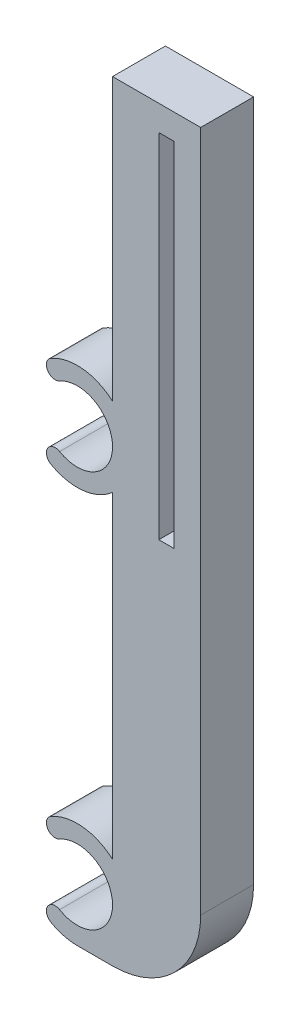
ISO-10303-21;
HEADER;
FILE_DESCRIPTION(('STEP AP214'),'2;1');
FILE_NAME('part.step','',(''),(''),'','','');
FILE_SCHEMA(('AUTOMOTIVE_DESIGN { 1 0 10303 214 1 1 1 1 }'));
ENDSEC;
DATA;
#1=APPLICATION_CONTEXT('core data for automotive mechanical design processes');
#2=APPLICATION_PROTOCOL_DEFINITION('international standard','automotive_design',2000,#1);
#3=PRODUCT_CONTEXT('',#1,'mechanical');
#4=PRODUCT('Part','Part','',(#3));
#5=PRODUCT_RELATED_PRODUCT_CATEGORY('part','',(#4));
#6=PRODUCT_DEFINITION_FORMATION('','',#4);
#7=PRODUCT_DEFINITION_CONTEXT('part definition',#1,'design');
#8=PRODUCT_DEFINITION('design','',#6,#7);
#9=PRODUCT_DEFINITION_SHAPE('','',#8);
#10=(LENGTH_UNIT() NAMED_UNIT(*) SI_UNIT(.MILLI.,.METRE.));
#11=(NAMED_UNIT(*) PLANE_ANGLE_UNIT() SI_UNIT($,.RADIAN.));
#12=(NAMED_UNIT(*) SI_UNIT($,.STERADIAN.) SOLID_ANGLE_UNIT());
#13=UNCERTAINTY_MEASURE_WITH_UNIT(LENGTH_MEASURE(1.E-05),#10,'distance_accuracy_value','');
#14=(GEOMETRIC_REPRESENTATION_CONTEXT(3) GLOBAL_UNCERTAINTY_ASSIGNED_CONTEXT((#13)) GLOBAL_UNIT_ASSIGNED_CONTEXT((#10,
#11,#12)) REPRESENTATION_CONTEXT('',''));
#15=CARTESIAN_POINT('',(0.,0.,0.));
#16=DIRECTION('',(0.,0.,1.));
#17=DIRECTION('',(1.,0.,0.));
#18=AXIS2_PLACEMENT_3D('',#15,#16,#17);
#19=CARTESIAN_POINT('',(7.50000000000032,87.3750000000002,6.));
#20=DIRECTION('',(0.,-1.,0.));
#21=DIRECTION('',(0.,0.,-1.));
#22=AXIS2_PLACEMENT_3D('',#19,#20,#21);
#23=PLANE('',#22);
#24=DIRECTION('',(-1.,0.,0.));
#25=VECTOR('',#24,1.);
#26=CARTESIAN_POINT('',(7.50000000000032,87.3750000000002,0.));
#27=LINE('',#26,#25);
#28=CARTESIAN_POINT('',(17.5000000000003,87.3750000000002,0.));
#29=VERTEX_POINT('',#28);
#30=CARTESIAN_POINT('',(7.50000000000032,87.3750000000002,0.));
#31=VERTEX_POINT('',#30);
#32=EDGE_CURVE('E188',#29,#31,#27,.T.);
#33=ORIENTED_EDGE('',*,*,#32,.T.);
#34=DIRECTION('',(0.,0.,-1.));
#35=VECTOR('',#34,1.);
#36=CARTESIAN_POINT('',(7.50000000000032,87.3750000000002,6.));
#37=LINE('',#36,#35);
#38=CARTESIAN_POINT('',(7.50000000000032,87.3750000000002,6.));
#39=VERTEX_POINT('',#38);
#40=EDGE_CURVE('E11',#39,#31,#37,.T.);
#41=ORIENTED_EDGE('',*,*,#40,.F.);
#42=DIRECTION('',(-1.,0.,0.));
#43=VECTOR('',#42,1.);
#44=CARTESIAN_POINT('',(7.50000000000032,87.3750000000002,6.));
#45=LINE('',#44,#43);
#46=CARTESIAN_POINT('',(17.5000000000003,87.3750000000002,6.));
#47=VERTEX_POINT('',#46);
#48=EDGE_CURVE('E220',#47,#39,#45,.T.);
#49=ORIENTED_EDGE('',*,*,#48,.F.);
#50=DIRECTION('',(0.,0.,-1.));
#51=VECTOR('',#50,1.);
#52=CARTESIAN_POINT('',(17.5000000000003,87.3750000000002,6.));
#53=LINE('',#52,#51);
#54=EDGE_CURVE('E184',#47,#29,#53,.T.);
#55=ORIENTED_EDGE('',*,*,#54,.T.);
#56=EDGE_LOOP('',(#33,#41,#49,#55));
#57=FACE_BOUND('',#56,.T.);
#58=ADVANCED_FACE('F32',(#57),#23,.F.);
#59=CARTESIAN_POINT('',(7.50000000000032,87.3750000000002,6.));
#60=DIRECTION('',(1.,0.,0.));
#61=DIRECTION('',(0.,1.,0.));
#62=AXIS2_PLACEMENT_3D('',#59,#60,#61);
#63=PLANE('',#62);
#64=DIRECTION('',(0.,-1.,0.));
#65=VECTOR('',#64,1.);
#66=CARTESIAN_POINT('',(7.50000000000032,87.3750000000002,0.));
#67=LINE('',#66,#65);
#68=CARTESIAN_POINT('',(7.50000000000032,55.4721359549989,0.));
#69=VERTEX_POINT('',#68);
#70=EDGE_CURVE('E191',#31,#69,#67,.T.);
#71=ORIENTED_EDGE('',*,*,#70,.T.);
#72=DIRECTION('',(0.,0.,-1.));
#73=VECTOR('',#72,1.);
#74=CARTESIAN_POINT('',(7.50000000000032,55.4721359549989,6.));
#75=LINE('',#74,#73);
#76=CARTESIAN_POINT('',(7.50000000000032,55.4721359549989,6.));
#77=VERTEX_POINT('',#76);
#78=EDGE_CURVE('E39',#77,#69,#75,.T.);
#79=ORIENTED_EDGE('',*,*,#78,.F.);
#80=DIRECTION('',(0.,-1.,0.));
#81=VECTOR('',#80,1.);
#82=CARTESIAN_POINT('',(7.50000000000032,87.3750000000002,6.));
#83=LINE('',#82,#81);
#84=EDGE_CURVE('E120',#39,#77,#83,.T.);
#85=ORIENTED_EDGE('',*,*,#84,.F.);
#86=ORIENTED_EDGE('',*,*,#40,.T.);
#87=EDGE_LOOP('',(#71,#79,#85,#86));
#88=FACE_BOUND('',#87,.T.);
#89=ADVANCED_FACE('F381',(#88),#63,.F.);
#90=CARTESIAN_POINT('',(3.50000000000152,51.,6.));
#91=DIRECTION('',(0.,0.,-1.));
#92=DIRECTION('',(-1.,0.,0.));
#93=AXIS2_PLACEMENT_3D('',#90,#91,#92);
#94=CYLINDRICAL_SURFACE('',#93,5.99999999999872);
#95=CARTESIAN_POINT('',(3.50000000000152,51.,0.));
#96=DIRECTION('',(0.,0.,1.));
#97=DIRECTION('',(-1.,0.,0.));
#98=AXIS2_PLACEMENT_3D('',#95,#96,#97);
#99=CIRCLE('',#98,5.99999999999872);
#100=CARTESIAN_POINT('',(0.500000000000728,56.1961524227046,0.));
#101=VERTEX_POINT('',#100);
#102=EDGE_CURVE('E194',#69,#101,#99,.T.);
#103=ORIENTED_EDGE('',*,*,#102,.T.);
#104=DIRECTION('',(0.,0.,-1.));
#105=VECTOR('',#104,1.);
#106=CARTESIAN_POINT('',(0.500000000000728,56.1961524227046,6.));
#107=LINE('',#106,#105);
#108=CARTESIAN_POINT('',(0.500000000000728,56.1961524227046,6.));
#109=VERTEX_POINT('',#108);
#110=EDGE_CURVE('E251',#109,#101,#107,.T.);
#111=ORIENTED_EDGE('',*,*,#110,.F.);
#112=CARTESIAN_POINT('',(3.50000000000152,51.,6.));
#113=DIRECTION('',(0.,0.,1.));
#114=DIRECTION('',(-1.,0.,0.));
#115=AXIS2_PLACEMENT_3D('',#112,#113,#114);
#116=CIRCLE('',#115,5.99999999999872);
#117=EDGE_CURVE('E259',#77,#109,#116,.T.);
#118=ORIENTED_EDGE('',*,*,#117,.F.);
#119=ORIENTED_EDGE('',*,*,#78,.T.);
#120=EDGE_LOOP('',(#103,#111,#118,#119));
#121=FACE_BOUND('',#120,.T.);
#122=ADVANCED_FACE('F257',(#121),#94,.T.);
#123=CARTESIAN_POINT('',(1.00000000000034,55.3301270189211,6.));
#124=DIRECTION('',(0.,0.,-1.));
#125=DIRECTION('',(-1.,0.,0.));
#126=AXIS2_PLACEMENT_3D('',#123,#124,#125);
#127=CYLINDRICAL_SURFACE('',#126,0.999999999998968);
#128=CARTESIAN_POINT('',(1.00000000000034,55.3301270189211,0.));
#129=DIRECTION('',(0.,0.,1.));
#130=DIRECTION('',(-1.,0.,0.));
#131=AXIS2_PLACEMENT_3D('',#128,#129,#130);
#132=CIRCLE('',#131,0.999999999998968);
#133=CARTESIAN_POINT('',(1.50000000000004,54.4641016151378,0.));
#134=VERTEX_POINT('',#133);
#135=EDGE_CURVE('E196',#101,#134,#132,.T.);
#136=ORIENTED_EDGE('',*,*,#135,.T.);
#137=DIRECTION('',(0.,0.,-1.));
#138=VECTOR('',#137,1.);
#139=CARTESIAN_POINT('',(1.50000000000004,54.4641016151378,6.));
#140=LINE('',#139,#138);
#141=CARTESIAN_POINT('',(1.50000000000004,54.4641016151378,6.));
#142=VERTEX_POINT('',#141);
#143=EDGE_CURVE('E248',#142,#134,#140,.T.);
#144=ORIENTED_EDGE('',*,*,#143,.F.);
#145=CARTESIAN_POINT('',(1.00000000000034,55.3301270189211,6.));
#146=DIRECTION('',(0.,0.,1.));
#147=DIRECTION('',(-1.,0.,0.));
#148=AXIS2_PLACEMENT_3D('',#145,#146,#147);
#149=CIRCLE('',#148,0.999999999998968);
#150=EDGE_CURVE('E277',#109,#142,#149,.T.);
#151=ORIENTED_EDGE('',*,*,#150,.F.);
#152=ORIENTED_EDGE('',*,*,#110,.T.);
#153=EDGE_LOOP('',(#136,#144,#151,#152));
#154=FACE_BOUND('',#153,.T.);
#155=ADVANCED_FACE('F268',(#154),#127,.T.);
#156=CARTESIAN_POINT('',(3.50000000000152,51.,6.));
#157=DIRECTION('',(0.,0.,-1.));
#158=DIRECTION('',(-1.,0.,0.));
#159=AXIS2_PLACEMENT_3D('',#156,#157,#158);
#160=CYLINDRICAL_SURFACE('',#159,4.0000000000008);
#161=CARTESIAN_POINT('',(3.50000000000152,51.,0.));
#162=DIRECTION('',(0.,0.,-1.));
#163=DIRECTION('',(-1.,0.,0.));
#164=AXIS2_PLACEMENT_3D('',#161,#162,#163);
#165=CIRCLE('',#164,4.0000000000008);
#166=CARTESIAN_POINT('',(1.50000000000022,47.535898384862,0.));
#167=VERTEX_POINT('',#166);
#168=EDGE_CURVE('E198',#134,#167,#165,.T.);
#169=ORIENTED_EDGE('',*,*,#168,.T.);
#170=DIRECTION('',(0.,0.,-1.));
#171=VECTOR('',#170,1.);
#172=CARTESIAN_POINT('',(1.50000000000022,47.535898384862,6.));
#173=LINE('',#172,#171);
#174=CARTESIAN_POINT('',(1.50000000000022,47.535898384862,6.));
#175=VERTEX_POINT('',#174);
#176=EDGE_CURVE('E245',#175,#167,#173,.T.);
#177=ORIENTED_EDGE('',*,*,#176,.F.);
#178=CARTESIAN_POINT('',(3.50000000000152,51.,6.));
#179=DIRECTION('',(0.,0.,-1.));
#180=DIRECTION('',(-1.,0.,0.));
#181=AXIS2_PLACEMENT_3D('',#178,#179,#180);
#182=CIRCLE('',#181,4.0000000000008);
#183=EDGE_CURVE('E274',#142,#175,#182,.T.);
#184=ORIENTED_EDGE('',*,*,#183,.F.);
#185=ORIENTED_EDGE('',*,*,#143,.T.);
#186=EDGE_LOOP('',(#169,#177,#184,#185));
#187=FACE_BOUND('',#186,.T.);
#188=ADVANCED_FACE('F272',(#187),#160,.F.);
#189=CARTESIAN_POINT('',(1.00000000000064,46.6698729810784,6.));
#190=DIRECTION('',(0.,0.,-1.));
#191=DIRECTION('',(-1.,0.,0.));
#192=AXIS2_PLACEMENT_3D('',#189,#190,#191);
#193=CYLINDRICAL_SURFACE('',#192,0.99999999999911);
#194=CARTESIAN_POINT('',(1.00000000000064,46.6698729810784,0.));
#195=DIRECTION('',(0.,0.,1.));
#196=DIRECTION('',(-1.,0.,0.));
#197=AXIS2_PLACEMENT_3D('',#194,#195,#196);
#198=CIRCLE('',#197,0.99999999999911);
#199=CARTESIAN_POINT('',(0.50000000000105,45.8038475772947,0.));
#200=VERTEX_POINT('',#199);
#201=EDGE_CURVE('E200',#167,#200,#198,.T.);
#202=ORIENTED_EDGE('',*,*,#201,.T.);
#203=DIRECTION('',(0.,0.,-1.));
#204=VECTOR('',#203,1.);
#205=CARTESIAN_POINT('',(0.50000000000105,45.8038475772947,6.));
#206=LINE('',#205,#204);
#207=CARTESIAN_POINT('',(0.50000000000105,45.8038475772947,6.));
#208=VERTEX_POINT('',#207);
#209=EDGE_CURVE('E242',#208,#200,#206,.T.);
#210=ORIENTED_EDGE('',*,*,#209,.F.);
#211=CARTESIAN_POINT('',(1.00000000000064,46.6698729810784,6.));
#212=DIRECTION('',(0.,0.,1.));
#213=DIRECTION('',(-1.,0.,0.));
#214=AXIS2_PLACEMENT_3D('',#211,#212,#213);
#215=CIRCLE('',#214,0.99999999999911);
#216=EDGE_CURVE('E276',#175,#208,#215,.T.);
#217=ORIENTED_EDGE('',*,*,#216,.F.);
#218=ORIENTED_EDGE('',*,*,#176,.T.);
#219=EDGE_LOOP('',(#202,#210,#217,#218));
#220=FACE_BOUND('',#219,.T.);
#221=ADVANCED_FACE('F394',(#220),#193,.T.);
#222=CARTESIAN_POINT('',(3.50000000000152,51.,6.));
#223=DIRECTION('',(0.,0.,-1.));
#224=DIRECTION('',(-1.,0.,0.));
#225=AXIS2_PLACEMENT_3D('',#222,#223,#224);
#226=CYLINDRICAL_SURFACE('',#225,5.99999999999904);
#227=CARTESIAN_POINT('',(3.50000000000152,51.,0.));
#228=DIRECTION('',(0.,0.,1.));
#229=DIRECTION('',(-1.,0.,0.));
#230=AXIS2_PLACEMENT_3D('',#227,#228,#229);
#231=CIRCLE('',#230,5.99999999999904);
#232=CARTESIAN_POINT('',(7.50000000000001,46.5278640450003,0.));
#233=VERTEX_POINT('',#232);
#234=EDGE_CURVE('E202',#200,#233,#231,.T.);
#235=ORIENTED_EDGE('',*,*,#234,.T.);
#236=DIRECTION('',(0.,0.,-1.));
#237=VECTOR('',#236,1.);
#238=CARTESIAN_POINT('',(7.50000000000001,46.5278640450003,6.));
#239=LINE('',#238,#237);
#240=CARTESIAN_POINT('',(7.50000000000001,46.5278640450003,6.));
#241=VERTEX_POINT('',#240);
#242=EDGE_CURVE('E239',#241,#233,#239,.T.);
#243=ORIENTED_EDGE('',*,*,#242,.F.);
#244=CARTESIAN_POINT('',(3.50000000000152,51.,6.));
#245=DIRECTION('',(0.,0.,1.));
#246=DIRECTION('',(-1.,0.,0.));
#247=AXIS2_PLACEMENT_3D('',#244,#245,#246);
#248=CIRCLE('',#247,5.99999999999904);
#249=EDGE_CURVE('E279',#208,#241,#248,.T.);
#250=ORIENTED_EDGE('',*,*,#249,.F.);
#251=ORIENTED_EDGE('',*,*,#209,.T.);
#252=EDGE_LOOP('',(#235,#243,#250,#251));
#253=FACE_BOUND('',#252,.T.);
#254=ADVANCED_FACE('F397',(#253),#226,.T.);
#255=CARTESIAN_POINT('',(7.50000000000001,10.4721359549992,6.));
#256=DIRECTION('',(1.,0.,0.));
#257=DIRECTION('',(0.,0.,-1.));
#258=AXIS2_PLACEMENT_3D('',#255,#256,#257);
#259=PLANE('',#258);
#260=DIRECTION('',(0.,-1.,0.));
#261=VECTOR('',#260,1.);
#262=CARTESIAN_POINT('',(7.50000000000001,10.4721359549992,0.));
#263=LINE('',#262,#261);
#264=CARTESIAN_POINT('',(7.50000000000001,10.4721359549992,0.));
#265=VERTEX_POINT('',#264);
#266=EDGE_CURVE('E204',#233,#265,#263,.T.);
#267=ORIENTED_EDGE('',*,*,#266,.T.);
#268=DIRECTION('',(0.,0.,-1.));
#269=VECTOR('',#268,1.);
#270=CARTESIAN_POINT('',(7.50000000000001,10.4721359549992,6.));
#271=LINE('',#270,#269);
#272=CARTESIAN_POINT('',(7.50000000000001,10.4721359549992,6.));
#273=VERTEX_POINT('',#272);
#274=EDGE_CURVE('E236',#273,#265,#271,.T.);
#275=ORIENTED_EDGE('',*,*,#274,.F.);
#276=DIRECTION('',(0.,-1.,0.));
#277=VECTOR('',#276,1.);
#278=CARTESIAN_POINT('',(7.50000000000001,10.4721359549992,6.));
#279=LINE('',#278,#277);
#280=EDGE_CURVE('E285',#241,#273,#279,.T.);
#281=ORIENTED_EDGE('',*,*,#280,.F.);
#282=ORIENTED_EDGE('',*,*,#242,.T.);
#283=EDGE_LOOP('',(#267,#275,#281,#282));
#284=FACE_BOUND('',#283,.T.);
#285=ADVANCED_FACE('F401',(#284),#259,.F.);
#286=CARTESIAN_POINT('',(3.4999999999999,5.99999999999986,6.));
#287=DIRECTION('',(0.,0.,-1.));
#288=DIRECTION('',(-1.,0.,0.));
#289=AXIS2_PLACEMENT_3D('',#286,#287,#288);
#290=CYLINDRICAL_SURFACE('',#289,5.99999999999986);
#291=CARTESIAN_POINT('',(3.4999999999999,5.99999999999986,0.));
#292=DIRECTION('',(0.,0.,1.));
#293=DIRECTION('',(-1.,0.,0.));
#294=AXIS2_PLACEMENT_3D('',#291,#292,#293);
#295=CIRCLE('',#294,5.99999999999986);
#296=CARTESIAN_POINT('',(0.500000000000031,11.1961524227064,0.));
#297=VERTEX_POINT('',#296);
#298=EDGE_CURVE('E206',#265,#297,#295,.T.);
#299=ORIENTED_EDGE('',*,*,#298,.T.);
#300=DIRECTION('',(0.,0.,-1.));
#301=VECTOR('',#300,1.);
#302=CARTESIAN_POINT('',(0.500000000000031,11.1961524227064,6.));
#303=LINE('',#302,#301);
#304=CARTESIAN_POINT('',(0.500000000000031,11.1961524227064,6.));
#305=VERTEX_POINT('',#304);
#306=EDGE_CURVE('E233',#305,#297,#303,.T.);
#307=ORIENTED_EDGE('',*,*,#306,.F.);
#308=CARTESIAN_POINT('',(3.4999999999999,5.99999999999986,6.));
#309=DIRECTION('',(0.,0.,1.));
#310=DIRECTION('',(-1.,0.,0.));
#311=AXIS2_PLACEMENT_3D('',#308,#309,#310);
#312=CIRCLE('',#311,5.99999999999986);
#313=EDGE_CURVE('E287',#273,#305,#312,.T.);
#314=ORIENTED_EDGE('',*,*,#313,.F.);
#315=ORIENTED_EDGE('',*,*,#274,.T.);
#316=EDGE_LOOP('',(#299,#307,#314,#315));
#317=FACE_BOUND('',#316,.T.);
#318=ADVANCED_FACE('F405',(#317),#290,.T.);
#319=CARTESIAN_POINT('',(0.999999999999959,10.3301270189221,6.));
#320=DIRECTION('',(0.,0.,-1.));
#321=DIRECTION('',(-1.,0.,0.));
#322=AXIS2_PLACEMENT_3D('',#319,#320,#321);
#323=CYLINDRICAL_SURFACE('',#322,0.999999999999879);
#324=CARTESIAN_POINT('',(0.999999999999959,10.3301270189221,0.));
#325=DIRECTION('',(0.,0.,1.));
#326=DIRECTION('',(-1.,0.,0.));
#327=AXIS2_PLACEMENT_3D('',#324,#325,#326);
#328=CIRCLE('',#327,0.999999999999879);
#329=CARTESIAN_POINT('',(1.49999999999989,9.46410161513774,0.));
#330=VERTEX_POINT('',#329);
#331=EDGE_CURVE('E208',#297,#330,#328,.T.);
#332=ORIENTED_EDGE('',*,*,#331,.T.);
#333=DIRECTION('',(0.,0.,-1.));
#334=VECTOR('',#333,1.);
#335=CARTESIAN_POINT('',(1.49999999999989,9.46410161513774,6.));
#336=LINE('',#335,#334);
#337=CARTESIAN_POINT('',(1.49999999999989,9.46410161513774,6.));
#338=VERTEX_POINT('',#337);
#339=EDGE_CURVE('E230',#338,#330,#336,.T.);
#340=ORIENTED_EDGE('',*,*,#339,.F.);
#341=CARTESIAN_POINT('',(0.999999999999959,10.3301270189221,6.));
#342=DIRECTION('',(0.,0.,1.));
#343=DIRECTION('',(-1.,0.,0.));
#344=AXIS2_PLACEMENT_3D('',#341,#342,#343);
#345=CIRCLE('',#344,0.999999999999879);
#346=EDGE_CURVE('E289',#305,#338,#345,.T.);
#347=ORIENTED_EDGE('',*,*,#346,.F.);
#348=ORIENTED_EDGE('',*,*,#306,.T.);
#349=EDGE_LOOP('',(#332,#340,#347,#348));
#350=FACE_BOUND('',#349,.T.);
#351=ADVANCED_FACE('F409',(#350),#323,.T.);
#352=CARTESIAN_POINT('',(3.4999999999999,5.99999999999986,6.));
#353=DIRECTION('',(0.,0.,-1.));
#354=DIRECTION('',(-1.,0.,0.));
#355=AXIS2_PLACEMENT_3D('',#352,#353,#354);
#356=CYLINDRICAL_SURFACE('',#355,4.00000000000011);
#357=CARTESIAN_POINT('',(3.4999999999999,5.99999999999986,0.));
#358=DIRECTION('',(0.,0.,-1.));
#359=DIRECTION('',(-1.,0.,0.));
#360=AXIS2_PLACEMENT_3D('',#357,#358,#359);
#361=CIRCLE('',#360,4.00000000000011);
#362=CARTESIAN_POINT('',(1.49999999999979,2.53589838486206,0.));
#363=VERTEX_POINT('',#362);
#364=EDGE_CURVE('E210',#330,#363,#361,.T.);
#365=ORIENTED_EDGE('',*,*,#364,.T.);
#366=DIRECTION('',(0.,0.,-1.));
#367=VECTOR('',#366,1.);
#368=CARTESIAN_POINT('',(1.49999999999979,2.53589838486206,6.));
#369=LINE('',#368,#367);
#370=CARTESIAN_POINT('',(1.49999999999979,2.53589838486206,6.));
#371=VERTEX_POINT('',#370);
#372=EDGE_CURVE('E227',#371,#363,#369,.T.);
#373=ORIENTED_EDGE('',*,*,#372,.F.);
#374=CARTESIAN_POINT('',(3.4999999999999,5.99999999999986,6.));
#375=DIRECTION('',(0.,0.,-1.));
#376=DIRECTION('',(-1.,0.,0.));
#377=AXIS2_PLACEMENT_3D('',#374,#375,#376);
#378=CIRCLE('',#377,4.00000000000011);
#379=EDGE_CURVE('E291',#338,#371,#378,.T.);
#380=ORIENTED_EDGE('',*,*,#379,.F.);
#381=ORIENTED_EDGE('',*,*,#339,.T.);
#382=EDGE_LOOP('',(#365,#373,#380,#381));
#383=FACE_BOUND('',#382,.T.);
#384=ADVANCED_FACE('F413',(#383),#356,.F.);
#385=CARTESIAN_POINT('',(0.999999999999879,1.6698729810777,6.));
#386=DIRECTION('',(0.,0.,-1.));
#387=DIRECTION('',(-1.,0.,0.));
#388=AXIS2_PLACEMENT_3D('',#385,#386,#387);
#389=CYLINDRICAL_SURFACE('',#388,0.99999999999988);
#390=CARTESIAN_POINT('',(0.999999999999879,1.6698729810777,0.));
#391=DIRECTION('',(0.,0.,1.));
#392=DIRECTION('',(-1.,0.,0.));
#393=AXIS2_PLACEMENT_3D('',#390,#391,#392);
#394=CIRCLE('',#393,0.99999999999988);
#395=CARTESIAN_POINT('',(0.499999999999934,0.803847577293372,0.));
#396=VERTEX_POINT('',#395);
#397=EDGE_CURVE('E212',#363,#396,#394,.T.);
#398=ORIENTED_EDGE('',*,*,#397,.T.);
#399=DIRECTION('',(0.,0.,-1.));
#400=VECTOR('',#399,1.);
#401=CARTESIAN_POINT('',(0.499999999999934,0.803847577293372,6.));
#402=LINE('',#401,#400);
#403=CARTESIAN_POINT('',(0.499999999999934,0.803847577293372,6.));
#404=VERTEX_POINT('',#403);
#405=EDGE_CURVE('E224',#404,#396,#402,.T.);
#406=ORIENTED_EDGE('',*,*,#405,.F.);
#407=CARTESIAN_POINT('',(0.999999999999879,1.6698729810777,6.));
#408=DIRECTION('',(0.,0.,1.));
#409=DIRECTION('',(-1.,0.,0.));
#410=AXIS2_PLACEMENT_3D('',#407,#408,#409);
#411=CIRCLE('',#410,0.99999999999988);
#412=EDGE_CURVE('E293',#371,#404,#411,.T.);
#413=ORIENTED_EDGE('',*,*,#412,.F.);
#414=ORIENTED_EDGE('',*,*,#372,.T.);
#415=EDGE_LOOP('',(#398,#406,#413,#414));
#416=FACE_BOUND('',#415,.T.);
#417=ADVANCED_FACE('F299',(#416),#389,.T.);
#418=CARTESIAN_POINT('',(3.4999999999999,5.99999999999986,6.));
#419=DIRECTION('',(0.,0.,-1.));
#420=DIRECTION('',(-1.,0.,0.));
#421=AXIS2_PLACEMENT_3D('',#418,#419,#420);
#422=CYLINDRICAL_SURFACE('',#421,5.99999999999986);
#423=CARTESIAN_POINT('',(3.4999999999999,5.99999999999986,0.));
#424=DIRECTION('',(0.,0.,1.));
#425=DIRECTION('',(-1.,0.,0.));
#426=AXIS2_PLACEMENT_3D('',#423,#424,#425);
#427=CIRCLE('',#426,5.99999999999986);
#428=CARTESIAN_POINT('',(3.4999999999999,0.,0.));
#429=VERTEX_POINT('',#428);
#430=EDGE_CURVE('E214',#396,#429,#427,.T.);
#431=ORIENTED_EDGE('',*,*,#430,.T.);
#432=DIRECTION('',(0.,0.,-1.));
#433=VECTOR('',#432,1.);
#434=CARTESIAN_POINT('',(3.4999999999999,0.,6.));
#435=LINE('',#434,#433);
#436=CARTESIAN_POINT('',(3.4999999999999,0.,6.));
#437=VERTEX_POINT('',#436);
#438=EDGE_CURVE('E179',#437,#429,#435,.T.);
#439=ORIENTED_EDGE('',*,*,#438,.F.);
#440=CARTESIAN_POINT('',(3.4999999999999,5.99999999999986,6.));
#441=DIRECTION('',(0.,0.,1.));
#442=DIRECTION('',(-1.,0.,0.));
#443=AXIS2_PLACEMENT_3D('',#440,#441,#442);
#444=CIRCLE('',#443,5.99999999999986);
#445=EDGE_CURVE('E167',#404,#437,#444,.T.);
#446=ORIENTED_EDGE('',*,*,#445,.F.);
#447=ORIENTED_EDGE('',*,*,#405,.T.);
#448=EDGE_LOOP('',(#431,#439,#446,#447));
#449=FACE_BOUND('',#448,.T.);
#450=ADVANCED_FACE('F303',(#449),#422,.T.);
#451=CARTESIAN_POINT('',(3.4999999999999,0.,6.));
#452=DIRECTION('',(0.,1.,0.));
#453=DIRECTION('',(0.,0.,1.));
#454=AXIS2_PLACEMENT_3D('',#451,#452,#453);
#455=PLANE('',#454);
#456=DIRECTION('',(1.,0.,0.));
#457=VECTOR('',#456,1.);
#458=CARTESIAN_POINT('',(3.4999999999999,0.,0.));
#459=LINE('',#458,#457);
#460=CARTESIAN_POINT('',(7.50000000000001,0.,0.));
#461=VERTEX_POINT('',#460);
#462=EDGE_CURVE('E176',#429,#461,#459,.T.);
#463=ORIENTED_EDGE('',*,*,#462,.T.);
#464=DIRECTION('',(0.,0.,-1.));
#465=VECTOR('',#464,1.);
#466=CARTESIAN_POINT('',(7.50000000000001,0.,6.));
#467=LINE('',#466,#465);
#468=CARTESIAN_POINT('',(7.50000000000001,0.,6.));
#469=VERTEX_POINT('',#468);
#470=EDGE_CURVE('E173',#469,#461,#467,.T.);
#471=ORIENTED_EDGE('',*,*,#470,.F.);
#472=DIRECTION('',(1.,0.,0.));
#473=VECTOR('',#472,1.);
#474=CARTESIAN_POINT('',(3.4999999999999,0.,6.));
#475=LINE('',#474,#473);
#476=EDGE_CURVE('E160',#437,#469,#475,.T.);
#477=ORIENTED_EDGE('',*,*,#476,.F.);
#478=ORIENTED_EDGE('',*,*,#438,.T.);
#479=EDGE_LOOP('',(#463,#471,#477,#478));
#480=FACE_BOUND('',#479,.T.);
#481=ADVANCED_FACE('F174',(#480),#455,.F.);
#482=CARTESIAN_POINT('',(7.50000000000001,10.0000000000003,6.));
#483=DIRECTION('',(0.,0.,-1.));
#484=DIRECTION('',(-1.,0.,0.));
#485=AXIS2_PLACEMENT_3D('',#482,#483,#484);
#486=CYLINDRICAL_SURFACE('',#485,10.0000000000003);
#487=CARTESIAN_POINT('',(7.50000000000001,10.0000000000003,0.));
#488=DIRECTION('',(0.,0.,1.));
#489=DIRECTION('',(1.,0.,0.));
#490=AXIS2_PLACEMENT_3D('',#487,#488,#489);
#491=CIRCLE('',#490,10.0000000000003);
#492=CARTESIAN_POINT('',(17.5000000000003,10.0000000000002,0.));
#493=VERTEX_POINT('',#492);
#494=EDGE_CURVE('E217',#461,#493,#491,.T.);
#495=ORIENTED_EDGE('',*,*,#494,.T.);
#496=DIRECTION('',(0.,0.,-1.));
#497=VECTOR('',#496,1.);
#498=CARTESIAN_POINT('',(17.5000000000003,10.0000000000002,6.));
#499=LINE('',#498,#497);
#500=CARTESIAN_POINT('',(17.5000000000003,10.0000000000002,6.));
#501=VERTEX_POINT('',#500);
#502=EDGE_CURVE('E180',#501,#493,#499,.T.);
#503=ORIENTED_EDGE('',*,*,#502,.F.);
#504=CARTESIAN_POINT('',(7.50000000000001,10.0000000000003,6.));
#505=DIRECTION('',(0.,0.,1.));
#506=DIRECTION('',(1.,0.,0.));
#507=AXIS2_PLACEMENT_3D('',#504,#505,#506);
#508=CIRCLE('',#507,10.0000000000003);
#509=EDGE_CURVE('E164',#469,#501,#508,.T.);
#510=ORIENTED_EDGE('',*,*,#509,.F.);
#511=ORIENTED_EDGE('',*,*,#470,.T.);
#512=EDGE_LOOP('',(#495,#503,#510,#511));
#513=FACE_BOUND('',#512,.T.);
#514=ADVANCED_FACE('F182',(#513),#486,.T.);
#515=CARTESIAN_POINT('',(17.5000000000003,87.3750000000002,6.));
#516=DIRECTION('',(-1.,0.,0.));
#517=DIRECTION('',(0.,-1.,0.));
#518=AXIS2_PLACEMENT_3D('',#515,#516,#517);
#519=PLANE('',#518);
#520=DIRECTION('',(0.,1.,0.));
#521=VECTOR('',#520,1.);
#522=CARTESIAN_POINT('',(17.5000000000003,87.3750000000002,0.));
#523=LINE('',#522,#521);
#524=EDGE_CURVE('E112',#493,#29,#523,.T.);
#525=ORIENTED_EDGE('',*,*,#524,.T.);
#526=ORIENTED_EDGE('',*,*,#54,.F.);
#527=DIRECTION('',(0.,1.,0.));
#528=VECTOR('',#527,1.);
#529=CARTESIAN_POINT('',(17.5000000000003,87.3750000000002,6.));
#530=LINE('',#529,#528);
#531=EDGE_CURVE('E55',#501,#47,#530,.T.);
#532=ORIENTED_EDGE('',*,*,#531,.F.);
#533=ORIENTED_EDGE('',*,*,#502,.T.);
#534=EDGE_LOOP('',(#525,#526,#532,#533));
#535=FACE_BOUND('',#534,.T.);
#536=ADVANCED_FACE('F304',(#535),#519,.F.);
#537=CARTESIAN_POINT('',(7.50000000000001,10.0000000000003,6.));
#538=DIRECTION('',(0.,0.,1.));
#539=DIRECTION('',(1.,0.,0.));
#540=AXIS2_PLACEMENT_3D('',#537,#538,#539);
#541=PLANE('',#540);
#542=DIRECTION('',(-1.,0.,0.));
#543=VECTOR('',#542,1.);
#544=CARTESIAN_POINT('',(14.5000000000003,84.5000000000002,6.));
#545=LINE('',#544,#543);
#546=CARTESIAN_POINT('',(14.5000000000003,84.5000000000002,6.));
#547=VERTEX_POINT('',#546);
#548=CARTESIAN_POINT('',(12.7500000000003,84.5000000000002,6.));
#549=VERTEX_POINT('',#548);
#550=EDGE_CURVE('E46',#547,#549,#545,.T.);
#551=ORIENTED_EDGE('',*,*,#550,.F.);
#552=DIRECTION('',(0.,1.,0.));
#553=VECTOR('',#552,1.);
#554=CARTESIAN_POINT('',(14.5000000000003,84.5000000000002,6.));
#555=LINE('',#554,#553);
#556=CARTESIAN_POINT('',(14.5000000000003,44.5000000000002,6.));
#557=VERTEX_POINT('',#556);
#558=EDGE_CURVE('E321',#557,#547,#555,.T.);
#559=ORIENTED_EDGE('',*,*,#558,.F.);
#560=DIRECTION('',(1.,0.,0.));
#561=VECTOR('',#560,1.);
#562=CARTESIAN_POINT('',(14.5000000000003,44.5000000000002,6.));
#563=LINE('',#562,#561);
#564=CARTESIAN_POINT('',(12.7500000000003,44.5000000000002,6.));
#565=VERTEX_POINT('',#564);
#566=EDGE_CURVE('E325',#565,#557,#563,.T.);
#567=ORIENTED_EDGE('',*,*,#566,.F.);
#568=DIRECTION('',(0.,-1.,0.));
#569=VECTOR('',#568,1.);
#570=CARTESIAN_POINT('',(12.7500000000003,84.5000000000002,6.));
#571=LINE('',#570,#569);
#572=EDGE_CURVE('E328',#549,#565,#571,.T.);
#573=ORIENTED_EDGE('',*,*,#572,.F.);
#574=EDGE_LOOP('',(#551,#559,#567,#573));
#575=FACE_BOUND('',#574,.T.);
#576=ORIENTED_EDGE('',*,*,#48,.T.);
#577=ORIENTED_EDGE('',*,*,#84,.T.);
#578=ORIENTED_EDGE('',*,*,#117,.T.);
#579=ORIENTED_EDGE('',*,*,#150,.T.);
#580=ORIENTED_EDGE('',*,*,#183,.T.);
#581=ORIENTED_EDGE('',*,*,#216,.T.);
#582=ORIENTED_EDGE('',*,*,#249,.T.);
#583=ORIENTED_EDGE('',*,*,#280,.T.);
#584=ORIENTED_EDGE('',*,*,#313,.T.);
#585=ORIENTED_EDGE('',*,*,#346,.T.);
#586=ORIENTED_EDGE('',*,*,#379,.T.);
#587=ORIENTED_EDGE('',*,*,#412,.T.);
#588=ORIENTED_EDGE('',*,*,#445,.T.);
#589=ORIENTED_EDGE('',*,*,#476,.T.);
#590=ORIENTED_EDGE('',*,*,#509,.T.);
#591=ORIENTED_EDGE('',*,*,#531,.T.);
#592=EDGE_LOOP('',(#576,#577,#578,#579,#580,#581,#582,#583,#584,#585,#586,#587,#588,#589,#590,#591));
#593=FACE_BOUND('',#592,.T.);
#594=ADVANCED_FACE('F162',(#575,#593),#541,.T.);
#595=CARTESIAN_POINT('',(7.50000000000001,10.0000000000003,0.));
#596=DIRECTION('',(0.,0.,1.));
#597=DIRECTION('',(1.,0.,0.));
#598=AXIS2_PLACEMENT_3D('',#595,#596,#597);
#599=PLANE('',#598);
#600=ORIENTED_EDGE('',*,*,#32,.F.);
#601=ORIENTED_EDGE('',*,*,#524,.F.);
#602=ORIENTED_EDGE('',*,*,#494,.F.);
#603=ORIENTED_EDGE('',*,*,#462,.F.);
#604=ORIENTED_EDGE('',*,*,#430,.F.);
#605=ORIENTED_EDGE('',*,*,#397,.F.);
#606=ORIENTED_EDGE('',*,*,#364,.F.);
#607=ORIENTED_EDGE('',*,*,#331,.F.);
#608=ORIENTED_EDGE('',*,*,#298,.F.);
#609=ORIENTED_EDGE('',*,*,#266,.F.);
#610=ORIENTED_EDGE('',*,*,#234,.F.);
#611=ORIENTED_EDGE('',*,*,#201,.F.);
#612=ORIENTED_EDGE('',*,*,#168,.F.);
#613=ORIENTED_EDGE('',*,*,#135,.F.);
#614=ORIENTED_EDGE('',*,*,#102,.F.);
#615=ORIENTED_EDGE('',*,*,#70,.F.);
#616=EDGE_LOOP('',(#600,#601,#602,#603,#604,#605,#606,#607,#608,#609,#610,#611,#612,#613,#614,#615));
#617=FACE_BOUND('',#616,.T.);
#618=ADVANCED_FACE('F263',(#617),#599,.F.);
#619=CARTESIAN_POINT('',(14.5000000000003,84.5000000000002,1.5));
#620=DIRECTION('',(0.,1.,0.));
#621=DIRECTION('',(0.,0.,1.));
#622=AXIS2_PLACEMENT_3D('',#619,#620,#621);
#623=PLANE('',#622);
#624=ORIENTED_EDGE('',*,*,#550,.T.);
#625=DIRECTION('',(0.,0.,1.));
#626=VECTOR('',#625,1.);
#627=CARTESIAN_POINT('',(12.7500000000003,84.5000000000002,1.5));
#628=LINE('',#627,#626);
#629=CARTESIAN_POINT('',(12.7500000000003,84.5000000000002,1.5));
#630=VERTEX_POINT('',#629);
#631=EDGE_CURVE('E311',#630,#549,#628,.T.);
#632=ORIENTED_EDGE('',*,*,#631,.F.);
#633=DIRECTION('',(-1.,0.,0.));
#634=VECTOR('',#633,1.);
#635=CARTESIAN_POINT('',(14.5000000000003,84.5000000000002,1.5));
#636=LINE('',#635,#634);
#637=CARTESIAN_POINT('',(14.5000000000003,84.5000000000002,1.5));
#638=VERTEX_POINT('',#637);
#639=EDGE_CURVE('E324',#638,#630,#636,.T.);
#640=ORIENTED_EDGE('',*,*,#639,.F.);
#641=DIRECTION('',(0.,0.,1.));
#642=VECTOR('',#641,1.);
#643=CARTESIAN_POINT('',(14.5000000000003,84.5000000000002,1.5));
#644=LINE('',#643,#642);
#645=EDGE_CURVE('E192',#638,#547,#644,.T.);
#646=ORIENTED_EDGE('',*,*,#645,.T.);
#647=EDGE_LOOP('',(#624,#632,#640,#646));
#648=FACE_BOUND('',#647,.T.);
#649=ADVANCED_FACE('F349',(#648),#623,.F.);
#650=CARTESIAN_POINT('',(14.5000000000003,84.5000000000002,1.5));
#651=DIRECTION('',(1.,0.,0.));
#652=DIRECTION('',(0.,1.,0.));
#653=AXIS2_PLACEMENT_3D('',#650,#651,#652);
#654=PLANE('',#653);
#655=ORIENTED_EDGE('',*,*,#558,.T.);
#656=ORIENTED_EDGE('',*,*,#645,.F.);
#657=DIRECTION('',(0.,1.,0.));
#658=VECTOR('',#657,1.);
#659=CARTESIAN_POINT('',(14.5000000000003,84.5000000000002,1.5));
#660=LINE('',#659,#658);
#661=CARTESIAN_POINT('',(14.5000000000003,44.5000000000002,1.5));
#662=VERTEX_POINT('',#661);
#663=EDGE_CURVE('E314',#662,#638,#660,.T.);
#664=ORIENTED_EDGE('',*,*,#663,.F.);
#665=DIRECTION('',(0.,0.,1.));
#666=VECTOR('',#665,1.);
#667=CARTESIAN_POINT('',(14.5000000000003,44.5000000000002,1.5));
#668=LINE('',#667,#666);
#669=EDGE_CURVE('E317',#662,#557,#668,.T.);
#670=ORIENTED_EDGE('',*,*,#669,.T.);
#671=EDGE_LOOP('',(#655,#656,#664,#670));
#672=FACE_BOUND('',#671,.T.);
#673=ADVANCED_FACE('F360',(#672),#654,.F.);
#674=CARTESIAN_POINT('',(14.5000000000003,44.5000000000002,1.5));
#675=DIRECTION('',(0.,-1.,0.));
#676=DIRECTION('',(1.,0.,0.));
#677=AXIS2_PLACEMENT_3D('',#674,#675,#676);
#678=PLANE('',#677);
#679=ORIENTED_EDGE('',*,*,#566,.T.);
#680=ORIENTED_EDGE('',*,*,#669,.F.);
#681=DIRECTION('',(1.,0.,0.));
#682=VECTOR('',#681,1.);
#683=CARTESIAN_POINT('',(14.5000000000003,44.5000000000002,1.5));
#684=LINE('',#683,#682);
#685=CARTESIAN_POINT('',(12.7500000000003,44.5000000000002,1.5));
#686=VERTEX_POINT('',#685);
#687=EDGE_CURVE('E334',#686,#662,#684,.T.);
#688=ORIENTED_EDGE('',*,*,#687,.F.);
#689=DIRECTION('',(0.,0.,1.));
#690=VECTOR('',#689,1.);
#691=CARTESIAN_POINT('',(12.7500000000003,44.5000000000002,1.5));
#692=LINE('',#691,#690);
#693=EDGE_CURVE('E313',#686,#565,#692,.T.);
#694=ORIENTED_EDGE('',*,*,#693,.T.);
#695=EDGE_LOOP('',(#679,#680,#688,#694));
#696=FACE_BOUND('',#695,.T.);
#697=ADVANCED_FACE('F365',(#696),#678,.F.);
#698=CARTESIAN_POINT('',(12.7500000000003,84.5000000000002,1.5));
#699=DIRECTION('',(-1.,0.,0.));
#700=DIRECTION('',(0.,0.,1.));
#701=AXIS2_PLACEMENT_3D('',#698,#699,#700);
#702=PLANE('',#701);
#703=ORIENTED_EDGE('',*,*,#572,.T.);
#704=ORIENTED_EDGE('',*,*,#693,.F.);
#705=DIRECTION('',(0.,-1.,0.));
#706=VECTOR('',#705,1.);
#707=CARTESIAN_POINT('',(12.7500000000003,84.5000000000002,1.5));
#708=LINE('',#707,#706);
#709=EDGE_CURVE('E337',#630,#686,#708,.T.);
#710=ORIENTED_EDGE('',*,*,#709,.F.);
#711=ORIENTED_EDGE('',*,*,#631,.T.);
#712=EDGE_LOOP('',(#703,#704,#710,#711));
#713=FACE_BOUND('',#712,.T.);
#714=ADVANCED_FACE('F370',(#713),#702,.F.);
#715=CARTESIAN_POINT('',(0.,0.,1.5));
#716=DIRECTION('',(0.,0.,1.));
#717=DIRECTION('',(1.,0.,0.));
#718=AXIS2_PLACEMENT_3D('',#715,#716,#717);
#719=PLANE('',#718);
#720=ORIENTED_EDGE('',*,*,#639,.T.);
#721=ORIENTED_EDGE('',*,*,#709,.T.);
#722=ORIENTED_EDGE('',*,*,#687,.T.);
#723=ORIENTED_EDGE('',*,*,#663,.T.);
#724=EDGE_LOOP('',(#720,#721,#722,#723));
#725=FACE_BOUND('',#724,.T.);
#726=ADVANCED_FACE('F344',(#725),#719,.T.);
#727=CLOSED_SHELL('',(#58,#89,#122,#155,#188,#221,#254,#285,#318,#351,#384,#417,#450,#481,#514,
#536,#594,#618,#649,#673,#697,#714,#726));
#728=MANIFOLD_SOLID_BREP('B2',#727);
#729=ADVANCED_BREP_SHAPE_REPRESENTATION('',(#18,#728),#14);
#730=SHAPE_DEFINITION_REPRESENTATION(#9,#729);
ENDSEC;
END-ISO-10303-21;
